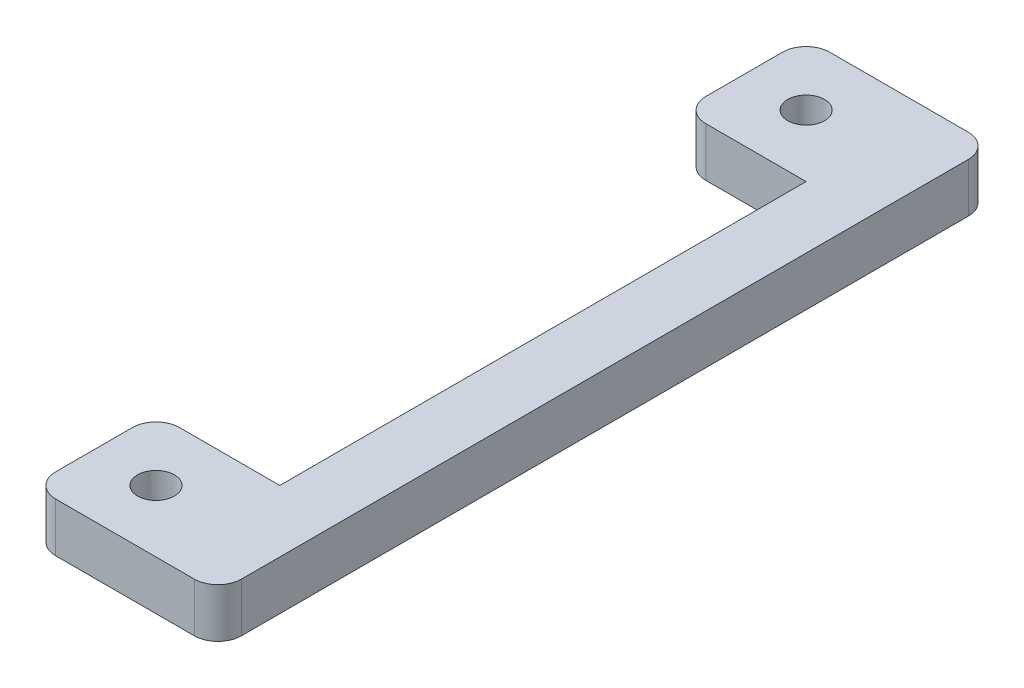
ISO-10303-21;
HEADER;
FILE_DESCRIPTION(('STEP AP214'),'2;1');
FILE_NAME('part.step','',(''),(''),'','','');
FILE_SCHEMA(('AUTOMOTIVE_DESIGN { 1 0 10303 214 1 1 1 1 }'));
ENDSEC;
DATA;
#1=APPLICATION_CONTEXT('core data for automotive mechanical design processes');
#2=APPLICATION_PROTOCOL_DEFINITION('international standard','automotive_design',2000,#1);
#3=PRODUCT_CONTEXT('',#1,'mechanical');
#4=PRODUCT('Part','Part','',(#3));
#5=PRODUCT_RELATED_PRODUCT_CATEGORY('part','',(#4));
#6=PRODUCT_DEFINITION_FORMATION('','',#4);
#7=PRODUCT_DEFINITION_CONTEXT('part definition',#1,'design');
#8=PRODUCT_DEFINITION('design','',#6,#7);
#9=PRODUCT_DEFINITION_SHAPE('','',#8);
#10=(LENGTH_UNIT() NAMED_UNIT(*) SI_UNIT(.MILLI.,.METRE.));
#11=(NAMED_UNIT(*) PLANE_ANGLE_UNIT() SI_UNIT($,.RADIAN.));
#12=(NAMED_UNIT(*) SI_UNIT($,.STERADIAN.) SOLID_ANGLE_UNIT());
#13=UNCERTAINTY_MEASURE_WITH_UNIT(LENGTH_MEASURE(1.E-05),#10,'distance_accuracy_value','');
#14=(GEOMETRIC_REPRESENTATION_CONTEXT(3) GLOBAL_UNCERTAINTY_ASSIGNED_CONTEXT((#13)) GLOBAL_UNIT_ASSIGNED_CONTEXT((#10,
#11,#12)) REPRESENTATION_CONTEXT('',''));
#15=CARTESIAN_POINT('',(0.,0.,0.));
#16=DIRECTION('',(0.,0.,1.));
#17=DIRECTION('',(1.,0.,0.));
#18=AXIS2_PLACEMENT_3D('',#15,#16,#17);
#19=CARTESIAN_POINT('',(0.,1.5875,0.));
#20=DIRECTION('',(0.,-1.,0.));
#21=DIRECTION('',(0.,0.,-1.));
#22=AXIS2_PLACEMENT_3D('',#19,#20,#21);
#23=PLANE('',#22);
#24=DIRECTION('',(-1.,0.,0.));
#25=VECTOR('',#24,1.);
#26=CARTESIAN_POINT('',(4.,1.5875,-25.));
#27=LINE('',#26,#25);
#28=CARTESIAN_POINT('',(5.23799999999999,1.5875,-25.));
#29=VERTEX_POINT('',#28);
#30=CARTESIAN_POINT('',(0.761999999999992,1.5875,-25.));
#31=VERTEX_POINT('',#30);
#32=EDGE_CURVE('E194',#29,#31,#27,.T.);
#33=ORIENTED_EDGE('',*,*,#32,.T.);
#34=CARTESIAN_POINT('',(0.761999999999992,1.5875,-24.238));
#35=DIRECTION('',(0.,-1.,0.));
#36=DIRECTION('',(0.,0.,-1.));
#37=AXIS2_PLACEMENT_3D('',#34,#35,#36);
#38=CIRCLE('',#37,0.762);
#39=CARTESIAN_POINT('',(0.,1.5875,-24.238));
#40=VERTEX_POINT('',#39);
#41=EDGE_CURVE('E225',#31,#40,#38,.F.);
#42=ORIENTED_EDGE('',*,*,#41,.T.);
#43=DIRECTION('',(0.,0.,1.));
#44=VECTOR('',#43,1.);
#45=CARTESIAN_POINT('',(0.,1.5875,-25.));
#46=LINE('',#45,#44);
#47=CARTESIAN_POINT('',(0.,1.5875,-21.762));
#48=VERTEX_POINT('',#47);
#49=EDGE_CURVE('E146',#40,#48,#46,.T.);
#50=ORIENTED_EDGE('',*,*,#49,.T.);
#51=CARTESIAN_POINT('',(0.761999999999999,1.5875,-21.762));
#52=DIRECTION('',(0.,-1.,0.));
#53=DIRECTION('',(0.,0.,-1.));
#54=AXIS2_PLACEMENT_3D('',#51,#52,#53);
#55=CIRCLE('',#54,0.762);
#56=CARTESIAN_POINT('',(0.761999999999999,1.5875,-21.));
#57=VERTEX_POINT('',#56);
#58=EDGE_CURVE('E142',#48,#57,#55,.F.);
#59=ORIENTED_EDGE('',*,*,#58,.T.);
#60=DIRECTION('',(1.,0.,0.));
#61=VECTOR('',#60,1.);
#62=CARTESIAN_POINT('',(0.,1.5875,-21.));
#63=LINE('',#62,#61);
#64=CARTESIAN_POINT('',(4.,1.5875,-21.));
#65=VERTEX_POINT('',#64);
#66=EDGE_CURVE('E132',#57,#65,#63,.T.);
#67=ORIENTED_EDGE('',*,*,#66,.T.);
#68=DIRECTION('',(0.,0.,1.));
#69=VECTOR('',#68,1.);
#70=CARTESIAN_POINT('',(4.,1.5875,-21.));
#71=LINE('',#70,#69);
#72=CARTESIAN_POINT('',(4.,1.5875,-4.));
#73=VERTEX_POINT('',#72);
#74=EDGE_CURVE('E138',#65,#73,#71,.T.);
#75=ORIENTED_EDGE('',*,*,#74,.T.);
#76=DIRECTION('',(-1.,0.,0.));
#77=VECTOR('',#76,1.);
#78=CARTESIAN_POINT('',(4.,1.5875,-4.));
#79=LINE('',#78,#77);
#80=CARTESIAN_POINT('',(0.762000000000001,1.5875,-4.));
#81=VERTEX_POINT('',#80);
#82=EDGE_CURVE('E161',#73,#81,#79,.T.);
#83=ORIENTED_EDGE('',*,*,#82,.T.);
#84=CARTESIAN_POINT('',(0.762000000000001,1.5875,-3.238));
#85=DIRECTION('',(0.,-1.,0.));
#86=DIRECTION('',(0.,0.,-1.));
#87=AXIS2_PLACEMENT_3D('',#84,#85,#86);
#88=CIRCLE('',#87,0.762);
#89=CARTESIAN_POINT('',(0.,1.5875,-3.238));
#90=VERTEX_POINT('',#89);
#91=EDGE_CURVE('E223',#81,#90,#88,.F.);
#92=ORIENTED_EDGE('',*,*,#91,.T.);
#93=DIRECTION('',(0.,0.,1.));
#94=VECTOR('',#93,1.);
#95=CARTESIAN_POINT('',(0.,1.5875,-4.));
#96=LINE('',#95,#94);
#97=CARTESIAN_POINT('',(0.,1.5875,-0.761999999999997));
#98=VERTEX_POINT('',#97);
#99=EDGE_CURVE('E163',#90,#98,#96,.T.);
#100=ORIENTED_EDGE('',*,*,#99,.T.);
#101=CARTESIAN_POINT('',(0.762000000000001,1.5875,-0.761999999999997));
#102=DIRECTION('',(0.,-1.,0.));
#103=DIRECTION('',(0.,0.,-1.));
#104=AXIS2_PLACEMENT_3D('',#101,#102,#103);
#105=CIRCLE('',#104,0.762);
#106=CARTESIAN_POINT('',(0.762000000000001,1.5875,0.));
#107=VERTEX_POINT('',#106);
#108=EDGE_CURVE('E220',#98,#107,#105,.F.);
#109=ORIENTED_EDGE('',*,*,#108,.T.);
#110=DIRECTION('',(1.,0.,0.));
#111=VECTOR('',#110,1.);
#112=CARTESIAN_POINT('',(0.,1.5875,0.));
#113=LINE('',#112,#111);
#114=CARTESIAN_POINT('',(5.23799999999999,1.5875,0.));
#115=VERTEX_POINT('',#114);
#116=EDGE_CURVE('E169',#107,#115,#113,.T.);
#117=ORIENTED_EDGE('',*,*,#116,.T.);
#118=CARTESIAN_POINT('',(5.23799999999999,1.5875,-0.761999999999999));
#119=DIRECTION('',(0.,-1.,0.));
#120=DIRECTION('',(0.,0.,-1.));
#121=AXIS2_PLACEMENT_3D('',#118,#119,#120);
#122=CIRCLE('',#121,0.762);
#123=CARTESIAN_POINT('',(5.99999999999999,1.5875,-0.761999999999999));
#124=VERTEX_POINT('',#123);
#125=EDGE_CURVE('E53',#115,#124,#122,.F.);
#126=ORIENTED_EDGE('',*,*,#125,.T.);
#127=DIRECTION('',(0.,0.,-1.));
#128=VECTOR('',#127,1.);
#129=CARTESIAN_POINT('',(5.99999999999999,1.5875,-25.));
#130=LINE('',#129,#128);
#131=CARTESIAN_POINT('',(5.99999999999999,1.5875,-24.238));
#132=VERTEX_POINT('',#131);
#133=EDGE_CURVE('E171',#124,#132,#130,.T.);
#134=ORIENTED_EDGE('',*,*,#133,.T.);
#135=CARTESIAN_POINT('',(5.23799999999999,1.5875,-24.238));
#136=DIRECTION('',(0.,-1.,0.));
#137=DIRECTION('',(0.,0.,-1.));
#138=AXIS2_PLACEMENT_3D('',#135,#136,#137);
#139=CIRCLE('',#138,0.762);
#140=EDGE_CURVE('E218',#132,#29,#139,.F.);
#141=ORIENTED_EDGE('',*,*,#140,.T.);
#142=EDGE_LOOP('',(#33,#42,#50,#59,#67,#75,#83,#92,#100,#109,#117,#126,#134,#141));
#143=FACE_BOUND('',#142,.T.);
#144=CARTESIAN_POINT('',(2.,1.5875,-23.));
#145=DIRECTION('',(0.,1.,0.));
#146=DIRECTION('',(0.,0.,1.));
#147=AXIS2_PLACEMENT_3D('',#144,#145,#146);
#148=CIRCLE('',#147,0.595630000000009);
#149=CARTESIAN_POINT('',(2.,1.5875,-22.40437));
#150=VERTEX_POINT('',#149);
#151=EDGE_CURVE('E177',#150,#150,#148,.T.);
#152=ORIENTED_EDGE('',*,*,#151,.F.);
#153=EDGE_LOOP('',(#152));
#154=FACE_BOUND('',#153,.T.);
#155=CARTESIAN_POINT('',(2.,1.5875,-2.));
#156=DIRECTION('',(0.,1.,0.));
#157=DIRECTION('',(0.,0.,1.));
#158=AXIS2_PLACEMENT_3D('',#155,#156,#157);
#159=CIRCLE('',#158,0.595630000000009);
#160=CARTESIAN_POINT('',(2.,1.5875,-1.40436999999999));
#161=VERTEX_POINT('',#160);
#162=EDGE_CURVE('E265',#161,#161,#159,.T.);
#163=ORIENTED_EDGE('',*,*,#162,.F.);
#164=EDGE_LOOP('',(#163));
#165=FACE_BOUND('',#164,.T.);
#166=ADVANCED_FACE('F33',(#143,#154,#165),#23,.F.);
#167=CARTESIAN_POINT('',(0.,0.,0.));
#168=DIRECTION('',(0.,-1.,0.));
#169=DIRECTION('',(0.,0.,-1.));
#170=AXIS2_PLACEMENT_3D('',#167,#168,#169);
#171=PLANE('',#170);
#172=CARTESIAN_POINT('',(2.,0.,-23.));
#173=DIRECTION('',(0.,1.,0.));
#174=DIRECTION('',(0.,0.,1.));
#175=AXIS2_PLACEMENT_3D('',#172,#173,#174);
#176=CIRCLE('',#175,0.595630000000009);
#177=CARTESIAN_POINT('',(2.,0.,-22.40437));
#178=VERTEX_POINT('',#177);
#179=EDGE_CURVE('E262',#178,#178,#176,.T.);
#180=ORIENTED_EDGE('',*,*,#179,.T.);
#181=EDGE_LOOP('',(#180));
#182=FACE_BOUND('',#181,.T.);
#183=DIRECTION('',(0.,0.,1.));
#184=VECTOR('',#183,1.);
#185=CARTESIAN_POINT('',(0.,0.,-25.));
#186=LINE('',#185,#184);
#187=CARTESIAN_POINT('',(0.,0.,-24.238));
#188=VERTEX_POINT('',#187);
#189=CARTESIAN_POINT('',(0.,0.,-21.762));
#190=VERTEX_POINT('',#189);
#191=EDGE_CURVE('E176',#188,#190,#186,.T.);
#192=ORIENTED_EDGE('',*,*,#191,.F.);
#193=CARTESIAN_POINT('',(0.761999999999992,0.,-24.238));
#194=DIRECTION('',(0.,-1.,0.));
#195=DIRECTION('',(0.,0.,-1.));
#196=AXIS2_PLACEMENT_3D('',#193,#194,#195);
#197=CIRCLE('',#196,0.762);
#198=CARTESIAN_POINT('',(0.761999999999992,0.,-25.));
#199=VERTEX_POINT('',#198);
#200=EDGE_CURVE('E210',#188,#199,#197,.T.);
#201=ORIENTED_EDGE('',*,*,#200,.T.);
#202=DIRECTION('',(-1.,0.,0.));
#203=VECTOR('',#202,1.);
#204=CARTESIAN_POINT('',(0.,0.,-25.));
#205=LINE('',#204,#203);
#206=CARTESIAN_POINT('',(5.23799999999999,0.,-25.));
#207=VERTEX_POINT('',#206);
#208=EDGE_CURVE('E173',#207,#199,#205,.T.);
#209=ORIENTED_EDGE('',*,*,#208,.F.);
#210=CARTESIAN_POINT('',(5.23799999999999,0.,-24.238));
#211=DIRECTION('',(0.,-1.,0.));
#212=DIRECTION('',(0.,0.,-1.));
#213=AXIS2_PLACEMENT_3D('',#210,#211,#212);
#214=CIRCLE('',#213,0.762);
#215=CARTESIAN_POINT('',(5.99999999999999,0.,-24.238));
#216=VERTEX_POINT('',#215);
#217=EDGE_CURVE('E202',#207,#216,#214,.T.);
#218=ORIENTED_EDGE('',*,*,#217,.T.);
#219=DIRECTION('',(0.,0.,-1.));
#220=VECTOR('',#219,1.);
#221=CARTESIAN_POINT('',(5.99999999999999,0.,-25.));
#222=LINE('',#221,#220);
#223=CARTESIAN_POINT('',(5.99999999999999,0.,-0.761999999999999));
#224=VERTEX_POINT('',#223);
#225=EDGE_CURVE('E192',#224,#216,#222,.T.);
#226=ORIENTED_EDGE('',*,*,#225,.F.);
#227=CARTESIAN_POINT('',(5.23799999999999,0.,-0.761999999999999));
#228=DIRECTION('',(0.,-1.,0.));
#229=DIRECTION('',(0.,0.,-1.));
#230=AXIS2_PLACEMENT_3D('',#227,#228,#229);
#231=CIRCLE('',#230,0.762);
#232=CARTESIAN_POINT('',(5.23799999999999,0.,0.));
#233=VERTEX_POINT('',#232);
#234=EDGE_CURVE('E200',#224,#233,#231,.T.);
#235=ORIENTED_EDGE('',*,*,#234,.T.);
#236=DIRECTION('',(1.,0.,0.));
#237=VECTOR('',#236,1.);
#238=CARTESIAN_POINT('',(5.99999999999999,0.,0.));
#239=LINE('',#238,#237);
#240=CARTESIAN_POINT('',(0.762000000000001,0.,0.));
#241=VERTEX_POINT('',#240);
#242=EDGE_CURVE('E189',#241,#233,#239,.T.);
#243=ORIENTED_EDGE('',*,*,#242,.F.);
#244=CARTESIAN_POINT('',(0.762000000000001,0.,-0.761999999999997));
#245=DIRECTION('',(0.,-1.,0.));
#246=DIRECTION('',(0.,0.,-1.));
#247=AXIS2_PLACEMENT_3D('',#244,#245,#246);
#248=CIRCLE('',#247,0.762);
#249=CARTESIAN_POINT('',(0.,0.,-0.761999999999997));
#250=VERTEX_POINT('',#249);
#251=EDGE_CURVE('E204',#241,#250,#248,.T.);
#252=ORIENTED_EDGE('',*,*,#251,.T.);
#253=DIRECTION('',(0.,0.,1.));
#254=VECTOR('',#253,1.);
#255=CARTESIAN_POINT('',(0.,0.,-4.));
#256=LINE('',#255,#254);
#257=CARTESIAN_POINT('',(0.,0.,-3.238));
#258=VERTEX_POINT('',#257);
#259=EDGE_CURVE('E186',#258,#250,#256,.T.);
#260=ORIENTED_EDGE('',*,*,#259,.F.);
#261=CARTESIAN_POINT('',(0.762000000000001,0.,-3.238));
#262=DIRECTION('',(0.,-1.,0.));
#263=DIRECTION('',(0.,0.,-1.));
#264=AXIS2_PLACEMENT_3D('',#261,#262,#263);
#265=CIRCLE('',#264,0.762);
#266=CARTESIAN_POINT('',(0.762000000000001,0.,-4.));
#267=VERTEX_POINT('',#266);
#268=EDGE_CURVE('E208',#258,#267,#265,.T.);
#269=ORIENTED_EDGE('',*,*,#268,.T.);
#270=DIRECTION('',(-1.,0.,0.));
#271=VECTOR('',#270,1.);
#272=CARTESIAN_POINT('',(4.,0.,-4.));
#273=LINE('',#272,#271);
#274=CARTESIAN_POINT('',(4.,0.,-4.));
#275=VERTEX_POINT('',#274);
#276=EDGE_CURVE('E183',#275,#267,#273,.T.);
#277=ORIENTED_EDGE('',*,*,#276,.F.);
#278=DIRECTION('',(0.,0.,1.));
#279=VECTOR('',#278,1.);
#280=CARTESIAN_POINT('',(4.,0.,-21.));
#281=LINE('',#280,#279);
#282=CARTESIAN_POINT('',(4.,0.,-21.));
#283=VERTEX_POINT('',#282);
#284=EDGE_CURVE('E181',#283,#275,#281,.T.);
#285=ORIENTED_EDGE('',*,*,#284,.F.);
#286=DIRECTION('',(1.,0.,0.));
#287=VECTOR('',#286,1.);
#288=CARTESIAN_POINT('',(0.,0.,-21.));
#289=LINE('',#288,#287);
#290=CARTESIAN_POINT('',(0.761999999999999,0.,-21.));
#291=VERTEX_POINT('',#290);
#292=EDGE_CURVE('E152',#291,#283,#289,.T.);
#293=ORIENTED_EDGE('',*,*,#292,.F.);
#294=CARTESIAN_POINT('',(0.761999999999999,0.,-21.762));
#295=DIRECTION('',(0.,-1.,0.));
#296=DIRECTION('',(0.,0.,-1.));
#297=AXIS2_PLACEMENT_3D('',#294,#295,#296);
#298=CIRCLE('',#297,0.762);
#299=EDGE_CURVE('E206',#291,#190,#298,.T.);
#300=ORIENTED_EDGE('',*,*,#299,.T.);
#301=EDGE_LOOP('',(#192,#201,#209,#218,#226,#235,#243,#252,#260,#269,#277,#285,#293,#300));
#302=FACE_BOUND('',#301,.T.);
#303=CARTESIAN_POINT('',(2.,0.,-2.));
#304=DIRECTION('',(0.,1.,0.));
#305=DIRECTION('',(0.,0.,1.));
#306=AXIS2_PLACEMENT_3D('',#303,#304,#305);
#307=CIRCLE('',#306,0.595630000000009);
#308=CARTESIAN_POINT('',(2.,0.,-1.40436999999999));
#309=VERTEX_POINT('',#308);
#310=EDGE_CURVE('E268',#309,#309,#307,.T.);
#311=ORIENTED_EDGE('',*,*,#310,.T.);
#312=EDGE_LOOP('',(#311));
#313=FACE_BOUND('',#312,.T.);
#314=ADVANCED_FACE('F247',(#182,#302,#313),#171,.T.);
#315=CARTESIAN_POINT('',(0.,1.5875,-25.));
#316=DIRECTION('',(0.,0.,1.));
#317=DIRECTION('',(1.,0.,0.));
#318=AXIS2_PLACEMENT_3D('',#315,#316,#317);
#319=PLANE('',#318);
#320=ORIENTED_EDGE('',*,*,#208,.T.);
#321=DIRECTION('',(0.,-1.,0.));
#322=VECTOR('',#321,1.);
#323=CARTESIAN_POINT('',(0.761999999999992,1.5875,-25.));
#324=LINE('',#323,#322);
#325=EDGE_CURVE('E215',#199,#31,#324,.F.);
#326=ORIENTED_EDGE('',*,*,#325,.T.);
#327=ORIENTED_EDGE('',*,*,#32,.F.);
#328=DIRECTION('',(0.,-1.,0.));
#329=VECTOR('',#328,1.);
#330=CARTESIAN_POINT('',(5.23799999999999,1.5875,-25.));
#331=LINE('',#330,#329);
#332=EDGE_CURVE('E212',#29,#207,#331,.T.);
#333=ORIENTED_EDGE('',*,*,#332,.T.);
#334=EDGE_LOOP('',(#320,#326,#327,#333));
#335=FACE_BOUND('',#334,.T.);
#336=ADVANCED_FACE('F257',(#335),#319,.F.);
#337=CARTESIAN_POINT('',(0.,1.5875,-25.));
#338=DIRECTION('',(1.,0.,0.));
#339=DIRECTION('',(0.,0.,-1.));
#340=AXIS2_PLACEMENT_3D('',#337,#338,#339);
#341=PLANE('',#340);
#342=ORIENTED_EDGE('',*,*,#49,.F.);
#343=DIRECTION('',(0.,-1.,0.));
#344=VECTOR('',#343,1.);
#345=CARTESIAN_POINT('',(0.,1.5875,-24.238));
#346=LINE('',#345,#344);
#347=EDGE_CURVE('E197',#40,#188,#346,.T.);
#348=ORIENTED_EDGE('',*,*,#347,.T.);
#349=ORIENTED_EDGE('',*,*,#191,.T.);
#350=DIRECTION('',(0.,-1.,0.));
#351=VECTOR('',#350,1.);
#352=CARTESIAN_POINT('',(0.,1.5875,-21.762));
#353=LINE('',#352,#351);
#354=EDGE_CURVE('E155',#190,#48,#353,.F.);
#355=ORIENTED_EDGE('',*,*,#354,.T.);
#356=EDGE_LOOP('',(#342,#348,#349,#355));
#357=FACE_BOUND('',#356,.T.);
#358=ADVANCED_FACE('F306',(#357),#341,.F.);
#359=CARTESIAN_POINT('',(0.,1.5875,-21.));
#360=DIRECTION('',(0.,0.,-1.));
#361=DIRECTION('',(-1.,0.,0.));
#362=AXIS2_PLACEMENT_3D('',#359,#360,#361);
#363=PLANE('',#362);
#364=ORIENTED_EDGE('',*,*,#66,.F.);
#365=DIRECTION('',(0.,-1.,0.));
#366=VECTOR('',#365,1.);
#367=CARTESIAN_POINT('',(0.761999999999999,1.5875,-21.));
#368=LINE('',#367,#366);
#369=EDGE_CURVE('E234',#57,#291,#368,.T.);
#370=ORIENTED_EDGE('',*,*,#369,.T.);
#371=ORIENTED_EDGE('',*,*,#292,.T.);
#372=DIRECTION('',(0.,-1.,0.));
#373=VECTOR('',#372,1.);
#374=CARTESIAN_POINT('',(4.,1.5875,-21.));
#375=LINE('',#374,#373);
#376=EDGE_CURVE('E149',#65,#283,#375,.T.);
#377=ORIENTED_EDGE('',*,*,#376,.F.);
#378=EDGE_LOOP('',(#364,#370,#371,#377));
#379=FACE_BOUND('',#378,.T.);
#380=ADVANCED_FACE('F150',(#379),#363,.F.);
#381=CARTESIAN_POINT('',(4.,1.5875,-21.));
#382=DIRECTION('',(1.,0.,0.));
#383=DIRECTION('',(0.,0.,-1.));
#384=AXIS2_PLACEMENT_3D('',#381,#382,#383);
#385=PLANE('',#384);
#386=ORIENTED_EDGE('',*,*,#284,.T.);
#387=DIRECTION('',(0.,-1.,0.));
#388=VECTOR('',#387,1.);
#389=CARTESIAN_POINT('',(4.,1.5875,-4.));
#390=LINE('',#389,#388);
#391=EDGE_CURVE('E156',#73,#275,#390,.T.);
#392=ORIENTED_EDGE('',*,*,#391,.F.);
#393=ORIENTED_EDGE('',*,*,#74,.F.);
#394=ORIENTED_EDGE('',*,*,#376,.T.);
#395=EDGE_LOOP('',(#386,#392,#393,#394));
#396=FACE_BOUND('',#395,.T.);
#397=ADVANCED_FACE('F158',(#396),#385,.F.);
#398=CARTESIAN_POINT('',(4.,1.5875,-4.));
#399=DIRECTION('',(0.,0.,1.));
#400=DIRECTION('',(1.,0.,0.));
#401=AXIS2_PLACEMENT_3D('',#398,#399,#400);
#402=PLANE('',#401);
#403=ORIENTED_EDGE('',*,*,#276,.T.);
#404=DIRECTION('',(0.,-1.,0.));
#405=VECTOR('',#404,1.);
#406=CARTESIAN_POINT('',(0.762000000000001,1.5875,-4.));
#407=LINE('',#406,#405);
#408=EDGE_CURVE('E232',#267,#81,#407,.F.);
#409=ORIENTED_EDGE('',*,*,#408,.T.);
#410=ORIENTED_EDGE('',*,*,#82,.F.);
#411=ORIENTED_EDGE('',*,*,#391,.T.);
#412=EDGE_LOOP('',(#403,#409,#410,#411));
#413=FACE_BOUND('',#412,.T.);
#414=ADVANCED_FACE('F297',(#413),#402,.F.);
#415=CARTESIAN_POINT('',(0.,1.5875,-4.));
#416=DIRECTION('',(1.,0.,0.));
#417=DIRECTION('',(0.,0.,-1.));
#418=AXIS2_PLACEMENT_3D('',#415,#416,#417);
#419=PLANE('',#418);
#420=ORIENTED_EDGE('',*,*,#99,.F.);
#421=DIRECTION('',(0.,-1.,0.));
#422=VECTOR('',#421,1.);
#423=CARTESIAN_POINT('',(0.,1.5875,-3.238));
#424=LINE('',#423,#422);
#425=EDGE_CURVE('E229',#90,#258,#424,.T.);
#426=ORIENTED_EDGE('',*,*,#425,.T.);
#427=ORIENTED_EDGE('',*,*,#259,.T.);
#428=DIRECTION('',(0.,-1.,0.));
#429=VECTOR('',#428,1.);
#430=CARTESIAN_POINT('',(0.,1.5875,-0.761999999999997));
#431=LINE('',#430,#429);
#432=EDGE_CURVE('E227',#250,#98,#431,.F.);
#433=ORIENTED_EDGE('',*,*,#432,.T.);
#434=EDGE_LOOP('',(#420,#426,#427,#433));
#435=FACE_BOUND('',#434,.T.);
#436=ADVANCED_FACE('F293',(#435),#419,.F.);
#437=CARTESIAN_POINT('',(5.99999999999999,1.5875,0.));
#438=DIRECTION('',(0.,0.,-1.));
#439=DIRECTION('',(-1.,0.,0.));
#440=AXIS2_PLACEMENT_3D('',#437,#438,#439);
#441=PLANE('',#440);
#442=ORIENTED_EDGE('',*,*,#116,.F.);
#443=DIRECTION('',(0.,-1.,0.));
#444=VECTOR('',#443,1.);
#445=CARTESIAN_POINT('',(0.762000000000001,1.5875,0.));
#446=LINE('',#445,#444);
#447=EDGE_CURVE('E238',#107,#241,#446,.T.);
#448=ORIENTED_EDGE('',*,*,#447,.T.);
#449=ORIENTED_EDGE('',*,*,#242,.T.);
#450=DIRECTION('',(0.,-1.,0.));
#451=VECTOR('',#450,1.);
#452=CARTESIAN_POINT('',(5.23799999999999,1.5875,0.));
#453=LINE('',#452,#451);
#454=EDGE_CURVE('E236',#233,#115,#453,.F.);
#455=ORIENTED_EDGE('',*,*,#454,.T.);
#456=EDGE_LOOP('',(#442,#448,#449,#455));
#457=FACE_BOUND('',#456,.T.);
#458=ADVANCED_FACE('F290',(#457),#441,.F.);
#459=CARTESIAN_POINT('',(5.99999999999999,1.5875,-25.));
#460=DIRECTION('',(-1.,0.,0.));
#461=DIRECTION('',(0.,0.,1.));
#462=AXIS2_PLACEMENT_3D('',#459,#460,#461);
#463=PLANE('',#462);
#464=ORIENTED_EDGE('',*,*,#225,.T.);
#465=DIRECTION('',(0.,-1.,0.));
#466=VECTOR('',#465,1.);
#467=CARTESIAN_POINT('',(5.99999999999999,1.5875,-24.238));
#468=LINE('',#467,#466);
#469=EDGE_CURVE('E11',#216,#132,#468,.F.);
#470=ORIENTED_EDGE('',*,*,#469,.T.);
#471=ORIENTED_EDGE('',*,*,#133,.F.);
#472=DIRECTION('',(0.,-1.,0.));
#473=VECTOR('',#472,1.);
#474=CARTESIAN_POINT('',(5.99999999999999,1.5875,-0.761999999999999));
#475=LINE('',#474,#473);
#476=EDGE_CURVE('E41',#124,#224,#475,.T.);
#477=ORIENTED_EDGE('',*,*,#476,.T.);
#478=EDGE_LOOP('',(#464,#470,#471,#477));
#479=FACE_BOUND('',#478,.T.);
#480=ADVANCED_FACE('F243',(#479),#463,.F.);
#481=CARTESIAN_POINT('',(2.,1.5875,-23.));
#482=DIRECTION('',(0.,-1.,0.));
#483=DIRECTION('',(0.,0.,-1.));
#484=AXIS2_PLACEMENT_3D('',#481,#482,#483);
#485=CYLINDRICAL_SURFACE('',#484,0.595630000000009);
#486=ORIENTED_EDGE('',*,*,#151,.T.);
#487=EDGE_LOOP('',(#486));
#488=FACE_BOUND('',#487,.T.);
#489=ORIENTED_EDGE('',*,*,#179,.F.);
#490=EDGE_LOOP('',(#489));
#491=FACE_BOUND('',#490,.T.);
#492=ADVANCED_FACE('F285',(#488,#491),#485,.F.);
#493=CARTESIAN_POINT('',(2.,1.5875,-2.));
#494=DIRECTION('',(0.,-1.,0.));
#495=DIRECTION('',(0.,0.,-1.));
#496=AXIS2_PLACEMENT_3D('',#493,#494,#495);
#497=CYLINDRICAL_SURFACE('',#496,0.595630000000009);
#498=ORIENTED_EDGE('',*,*,#162,.T.);
#499=EDGE_LOOP('',(#498));
#500=FACE_BOUND('',#499,.T.);
#501=ORIENTED_EDGE('',*,*,#310,.F.);
#502=EDGE_LOOP('',(#501));
#503=FACE_BOUND('',#502,.T.);
#504=ADVANCED_FACE('F274',(#500,#503),#497,.F.);
#505=CARTESIAN_POINT('',(0.761999999999992,1.5875,-24.238));
#506=DIRECTION('',(0.,-1.,0.));
#507=DIRECTION('',(0.,0.,-1.));
#508=AXIS2_PLACEMENT_3D('',#505,#506,#507);
#509=CYLINDRICAL_SURFACE('',#508,0.762);
#510=ORIENTED_EDGE('',*,*,#41,.F.);
#511=ORIENTED_EDGE('',*,*,#325,.F.);
#512=ORIENTED_EDGE('',*,*,#200,.F.);
#513=ORIENTED_EDGE('',*,*,#347,.F.);
#514=EDGE_LOOP('',(#510,#511,#512,#513));
#515=FACE_BOUND('',#514,.T.);
#516=ADVANCED_FACE('F312',(#515),#509,.T.);
#517=CARTESIAN_POINT('',(0.762000000000001,1.5875,-3.238));
#518=DIRECTION('',(0.,-1.,0.));
#519=DIRECTION('',(0.,0.,-1.));
#520=AXIS2_PLACEMENT_3D('',#517,#518,#519);
#521=CYLINDRICAL_SURFACE('',#520,0.762);
#522=ORIENTED_EDGE('',*,*,#91,.F.);
#523=ORIENTED_EDGE('',*,*,#408,.F.);
#524=ORIENTED_EDGE('',*,*,#268,.F.);
#525=ORIENTED_EDGE('',*,*,#425,.F.);
#526=EDGE_LOOP('',(#522,#523,#524,#525));
#527=FACE_BOUND('',#526,.T.);
#528=ADVANCED_FACE('F315',(#527),#521,.T.);
#529=CARTESIAN_POINT('',(0.761999999999999,1.5875,-21.762));
#530=DIRECTION('',(0.,-1.,0.));
#531=DIRECTION('',(0.,0.,-1.));
#532=AXIS2_PLACEMENT_3D('',#529,#530,#531);
#533=CYLINDRICAL_SURFACE('',#532,0.762);
#534=ORIENTED_EDGE('',*,*,#58,.F.);
#535=ORIENTED_EDGE('',*,*,#354,.F.);
#536=ORIENTED_EDGE('',*,*,#299,.F.);
#537=ORIENTED_EDGE('',*,*,#369,.F.);
#538=EDGE_LOOP('',(#534,#535,#536,#537));
#539=FACE_BOUND('',#538,.T.);
#540=ADVANCED_FACE('F319',(#539),#533,.T.);
#541=CARTESIAN_POINT('',(0.762000000000001,1.5875,-0.761999999999997));
#542=DIRECTION('',(0.,-1.,0.));
#543=DIRECTION('',(0.,0.,-1.));
#544=AXIS2_PLACEMENT_3D('',#541,#542,#543);
#545=CYLINDRICAL_SURFACE('',#544,0.762);
#546=ORIENTED_EDGE('',*,*,#108,.F.);
#547=ORIENTED_EDGE('',*,*,#432,.F.);
#548=ORIENTED_EDGE('',*,*,#251,.F.);
#549=ORIENTED_EDGE('',*,*,#447,.F.);
#550=EDGE_LOOP('',(#546,#547,#548,#549));
#551=FACE_BOUND('',#550,.T.);
#552=ADVANCED_FACE('F323',(#551),#545,.T.);
#553=CARTESIAN_POINT('',(5.23799999999999,1.5875,-24.238));
#554=DIRECTION('',(0.,-1.,0.));
#555=DIRECTION('',(0.,0.,-1.));
#556=AXIS2_PLACEMENT_3D('',#553,#554,#555);
#557=CYLINDRICAL_SURFACE('',#556,0.762);
#558=ORIENTED_EDGE('',*,*,#140,.F.);
#559=ORIENTED_EDGE('',*,*,#469,.F.);
#560=ORIENTED_EDGE('',*,*,#217,.F.);
#561=ORIENTED_EDGE('',*,*,#332,.F.);
#562=EDGE_LOOP('',(#558,#559,#560,#561));
#563=FACE_BOUND('',#562,.T.);
#564=ADVANCED_FACE('F254',(#563),#557,.T.);
#565=CARTESIAN_POINT('',(5.23799999999999,1.5875,-0.761999999999999));
#566=DIRECTION('',(0.,-1.,0.));
#567=DIRECTION('',(0.,0.,-1.));
#568=AXIS2_PLACEMENT_3D('',#565,#566,#567);
#569=CYLINDRICAL_SURFACE('',#568,0.762);
#570=ORIENTED_EDGE('',*,*,#125,.F.);
#571=ORIENTED_EDGE('',*,*,#454,.F.);
#572=ORIENTED_EDGE('',*,*,#234,.F.);
#573=ORIENTED_EDGE('',*,*,#476,.F.);
#574=EDGE_LOOP('',(#570,#571,#572,#573));
#575=FACE_BOUND('',#574,.T.);
#576=ADVANCED_FACE('F35',(#575),#569,.T.);
#577=CLOSED_SHELL('',(#166,#314,#336,#358,#380,#397,#414,#436,#458,#480,#492,#504,#516,#528,
#540,#552,#564,#576));
#578=MANIFOLD_SOLID_BREP('B2',#577);
#579=ADVANCED_BREP_SHAPE_REPRESENTATION('',(#18,#578),#14);
#580=SHAPE_DEFINITION_REPRESENTATION(#9,#579);
ENDSEC;
END-ISO-10303-21;
